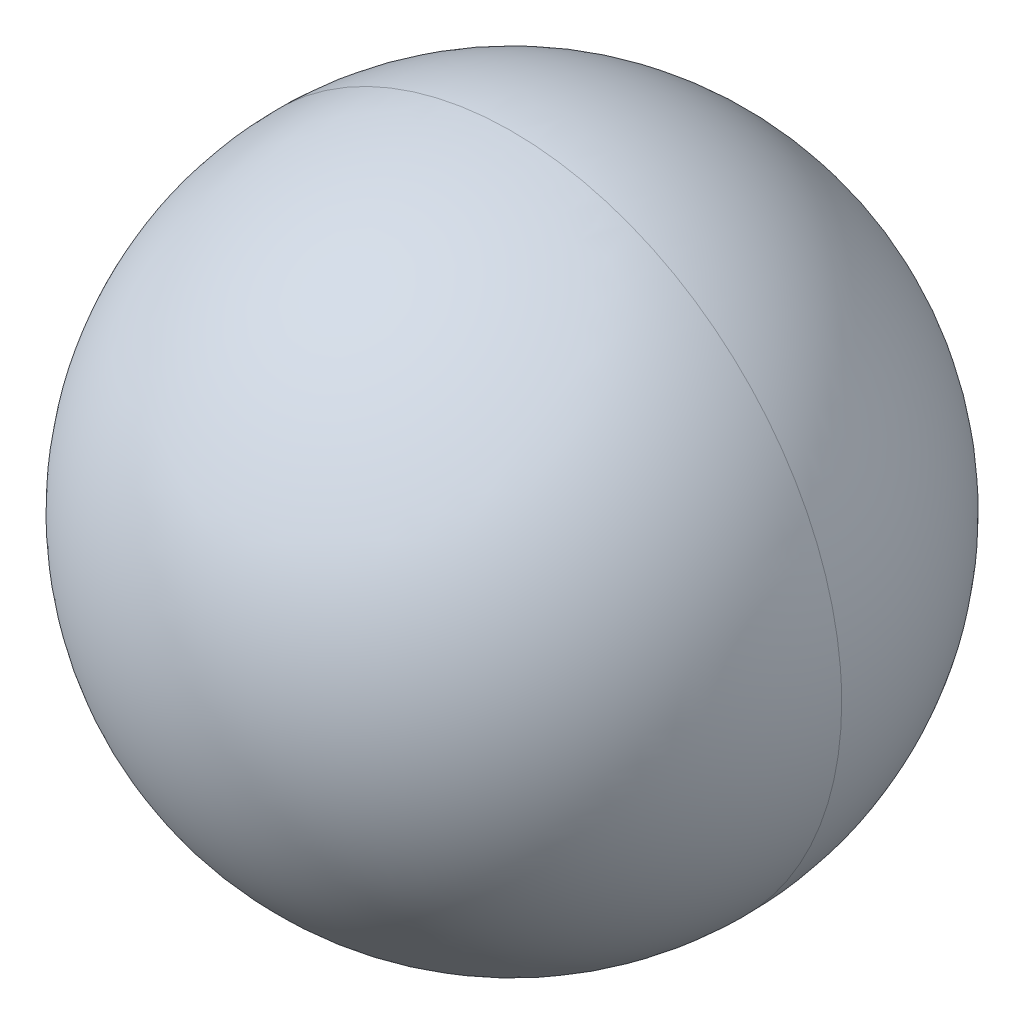
ISO-10303-21;
HEADER;
FILE_DESCRIPTION(('STEP AP214'),'2;1');
FILE_NAME('part.step','',(''),(''),'','','');
FILE_SCHEMA(('AUTOMOTIVE_DESIGN { 1 0 10303 214 1 1 1 1 }'));
ENDSEC;
DATA;
#1=APPLICATION_CONTEXT('core data for automotive mechanical design processes');
#2=APPLICATION_PROTOCOL_DEFINITION('international standard','automotive_design',2000,#1);
#3=PRODUCT_CONTEXT('',#1,'mechanical');
#4=PRODUCT('Part','Part','',(#3));
#5=PRODUCT_RELATED_PRODUCT_CATEGORY('part','',(#4));
#6=PRODUCT_DEFINITION_FORMATION('','',#4);
#7=PRODUCT_DEFINITION_CONTEXT('part definition',#1,'design');
#8=PRODUCT_DEFINITION('design','',#6,#7);
#9=PRODUCT_DEFINITION_SHAPE('','',#8);
#10=(LENGTH_UNIT() NAMED_UNIT(*) SI_UNIT(.MILLI.,.METRE.));
#11=(NAMED_UNIT(*) PLANE_ANGLE_UNIT() SI_UNIT($,.RADIAN.));
#12=(NAMED_UNIT(*) SI_UNIT($,.STERADIAN.) SOLID_ANGLE_UNIT());
#13=UNCERTAINTY_MEASURE_WITH_UNIT(LENGTH_MEASURE(1.E-05),#10,'distance_accuracy_value','');
#14=(GEOMETRIC_REPRESENTATION_CONTEXT(3) GLOBAL_UNCERTAINTY_ASSIGNED_CONTEXT((#13)) GLOBAL_UNIT_ASSIGNED_CONTEXT((#10,
#11,#12)) REPRESENTATION_CONTEXT('',''));
#15=CARTESIAN_POINT('',(0.,0.,0.));
#16=DIRECTION('',(0.,0.,1.));
#17=DIRECTION('',(1.,0.,0.));
#18=AXIS2_PLACEMENT_3D('',#15,#16,#17);
#19=CARTESIAN_POINT('',(8.,19.5,0.));
#20=DIRECTION('',(1.,0.,0.));
#21=DIRECTION('',(0.,0.,1.));
#22=AXIS2_PLACEMENT_3D('',#19,#20,#21);
#23=SPHERICAL_SURFACE('',#22,5.1595);
#24=CARTESIAN_POINT('',(8.,19.5,0.));
#25=DIRECTION('',(0.,0.,1.));
#26=DIRECTION('',(0.,-1.,0.));
#27=AXIS2_PLACEMENT_3D('',#24,#25,#26);
#28=CIRCLE('',#27,5.1595);
#29=CARTESIAN_POINT('',(2.8405,19.5,0.));
#30=VERTEX_POINT('',#29);
#31=CARTESIAN_POINT('',(13.1595,19.5,0.));
#32=VERTEX_POINT('',#31);
#33=EDGE_CURVE('E11',#30,#32,#28,.T.);
#34=ORIENTED_EDGE('',*,*,#33,.F.);
#35=CARTESIAN_POINT('',(2.8405,19.5,0.));
#36=CARTESIAN_POINT('',(2.84049820919547,19.5844222065871,0.));
#37=CARTESIAN_POINT('',(2.84257196684278,19.6688442607942,0.));
#38=CARTESIAN_POINT('',(2.85085772057605,19.8374850705904,0.));
#39=CARTESIAN_POINT('',(2.85706971666202,19.9217038261795,0.));
#40=CARTESIAN_POINT('',(2.87361908880758,20.0897350448813,0.));
#41=CARTESIAN_POINT('',(2.88395646486718,20.173547507994,0.));
#42=CARTESIAN_POINT('',(2.90873112880625,20.3405642579109,0.));
#43=CARTESIAN_POINT('',(2.92316841668573,20.4237685447151,0.));
#44=CARTESIAN_POINT('',(2.95610827483334,20.5893684881693,0.));
#45=CARTESIAN_POINT('',(2.97461084510147,20.6717641448193,0.));
#46=CARTESIAN_POINT('',(3.01563665318403,20.8355483316024,0.));
#47=CARTESIAN_POINT('',(3.03815989099846,20.9169368617355,0.));
#48=CARTESIAN_POINT('',(3.08717278458088,21.0785107228533,0.));
#49=CARTESIAN_POINT('',(3.11366244034887,21.158696053838,0.));
#50=CARTESIAN_POINT('',(3.17054435102754,21.3176703433163,0.));
#51=CARTESIAN_POINT('',(3.20093660593821,21.3964593018099,0.));
#52=CARTESIAN_POINT('',(3.26555049807782,21.5524510367655,0.));
#53=CARTESIAN_POINT('',(3.29977213530676,21.6296538132275,0.));
#54=CARTESIAN_POINT('',(3.37196234895243,21.7822871958796,0.));
#55=CARTESIAN_POINT('',(3.40993092536916,21.8577178020696,0.));
#56=CARTESIAN_POINT('',(3.48952354782016,22.0066251252378,0.));
#57=CARTESIAN_POINT('',(3.53114759385443,22.0801018422159,0.));
#58=CARTESIAN_POINT('',(3.61795087955276,22.2249243751139,0.));
#59=CARTESIAN_POINT('',(3.66313011921683,22.2962701910338,0.));
#60=CARTESIAN_POINT('',(3.7569349514332,22.4366590434955,0.));
#61=CARTESIAN_POINT('',(3.80556054398551,22.5057020800372,0.));
#62=CARTESIAN_POINT('',(3.90614093866571,22.6413190430202,0.));
#63=CARTESIAN_POINT('',(3.95809574079362,22.7078929694614,0.));
#64=CARTESIAN_POINT('',(4.06520939095629,22.8384113298233,0.));
#65=CARTESIAN_POINT('',(4.12036823899106,22.9023557637439,0.));
#66=CARTESIAN_POINT('',(4.23375709847111,23.0274610913225,0.));
#67=CARTESIAN_POINT('',(4.2919871099164,23.0886219849804,0.));
#68=CARTESIAN_POINT('',(4.4113780150196,23.2080128900836,0.));
#69=CARTESIAN_POINT('',(4.47253890867752,23.2662429015289,0.));
#70=CARTESIAN_POINT('',(4.59764423625609,23.3796317610089,0.));
#71=CARTESIAN_POINT('',(4.66158867017674,23.4347906090437,0.));
#72=CARTESIAN_POINT('',(4.79210703053859,23.5419042592064,0.));
#73=CARTESIAN_POINT('',(4.8586809569798,23.5938590613343,0.));
#74=CARTESIAN_POINT('',(4.99429791996277,23.6944394560144,0.));
#75=CARTESIAN_POINT('',(5.06334095650454,23.7430650485665,0.));
#76=CARTESIAN_POINT('',(5.20372980896617,23.8368698807834,0.));
#77=CARTESIAN_POINT('',(5.27507562488602,23.8820491204481,0.));
#78=CARTESIAN_POINT('',(5.41989815778411,23.9688524061447,0.));
#79=CARTESIAN_POINT('',(5.49337487476234,24.0104764521764,0.));
#80=CARTESIAN_POINT('',(5.64228219793018,24.0900690746343,0.));
#81=CARTESIAN_POINT('',(5.71771280411978,24.1280376510603,0.));
#82=CARTESIAN_POINT('',(5.87034618677312,24.2002278646805,0.));
#83=CARTESIAN_POINT('',(5.94754896323685,24.2344495018746,0.));
#84=CARTESIAN_POINT('',(6.10354069818777,24.2990633941094,0.));
#85=CARTESIAN_POINT('',(6.18232965667496,24.32945564915,0.));
#86=CARTESIAN_POINT('',(6.3413039461707,24.3863375594735,0.));
#87=CARTESIAN_POINT('',(6.42148927717926,24.4128272147563,0.));
#88=CARTESIAN_POINT('',(6.58306313823193,24.4618401096643,0.));
#89=CARTESIAN_POINT('',(6.66445166827604,24.4843633492895,0.));
#90=CARTESIAN_POINT('',(6.82823585530216,24.525389152425,0.));
#91=CARTESIAN_POINT('',(6.91063151228416,24.5438917159355,0.));
#92=CARTESIAN_POINT('',(7.07623145483139,24.5768315925455,0.));
#93=CARTESIAN_POINT('',(7.15943574039661,24.591268905645,0.));
#94=CARTESIAN_POINT('',(7.3264524936985,24.6160435006815,0.));
#95=CARTESIAN_POINT('',(7.41026496143517,24.6263807826184,0.));
#96=CARTESIAN_POINT('',(7.57829616750408,24.642930411912,0.));
#97=CARTESIAN_POINT('',(7.66251490583632,24.6491427592686,0.));
#98=CARTESIAN_POINT('',(7.83115576277904,24.6574275533126,0.));
#99=CARTESIAN_POINT('',(7.91557788138951,24.6595,0.));
#100=CARTESIAN_POINT('',(8.08442211861047,24.6595,0.));
#101=CARTESIAN_POINT('',(8.16884423722094,24.6574275533126,0.));
#102=CARTESIAN_POINT('',(8.33748509416366,24.6491427592686,0.));
#103=CARTESIAN_POINT('',(8.4217038324959,24.642930411912,0.));
#104=CARTESIAN_POINT('',(8.58973503856481,24.6263807826184,0.));
#105=CARTESIAN_POINT('',(8.67354750630148,24.6160435006815,0.));
#106=CARTESIAN_POINT('',(8.84056425960337,24.591268905645,0.));
#107=CARTESIAN_POINT('',(8.92376854516859,24.5768315925455,0.));
#108=CARTESIAN_POINT('',(9.08936848771581,24.5438917159355,0.));
#109=CARTESIAN_POINT('',(9.17176414469782,24.525389152425,0.));
#110=CARTESIAN_POINT('',(9.33554833172394,24.4843633492895,0.));
#111=CARTESIAN_POINT('',(9.41693686176805,24.4618401096643,0.));
#112=CARTESIAN_POINT('',(9.57851072282072,24.4128272147564,0.));
#113=CARTESIAN_POINT('',(9.65869605382928,24.3863375594735,0.));
#114=CARTESIAN_POINT('',(9.81767034332502,24.3294556491501,0.));
#115=CARTESIAN_POINT('',(9.89645930181221,24.2990633941094,0.));
#116=CARTESIAN_POINT('',(10.0524510367631,24.2344495018746,0.));
#117=CARTESIAN_POINT('',(10.1296538132269,24.2002278646805,0.));
#118=CARTESIAN_POINT('',(10.2822871958802,24.1280376510603,0.));
#119=CARTESIAN_POINT('',(10.3577178020698,24.0900690746343,0.));
#120=CARTESIAN_POINT('',(10.5066251252376,24.0104764521764,0.));
#121=CARTESIAN_POINT('',(10.5801018422159,23.9688524061447,0.));
#122=CARTESIAN_POINT('',(10.724924375114,23.8820491204482,0.));
#123=CARTESIAN_POINT('',(10.7962701910338,23.8368698807834,0.));
#124=CARTESIAN_POINT('',(10.9366590434954,23.7430650485666,0.));
#125=CARTESIAN_POINT('',(11.0057020800372,23.6944394560144,0.));
#126=CARTESIAN_POINT('',(11.1413190430202,23.5938590613344,0.));
#127=CARTESIAN_POINT('',(11.2078929694614,23.5419042592064,0.));
#128=CARTESIAN_POINT('',(11.3384113298232,23.4347906090437,0.));
#129=CARTESIAN_POINT('',(11.4023557637439,23.3796317610089,0.));
#130=CARTESIAN_POINT('',(11.5274610913225,23.2662429015289,0.));
#131=CARTESIAN_POINT('',(11.5886219849804,23.2080128900836,0.));
#132=CARTESIAN_POINT('',(11.7080128900836,23.0886219849804,0.));
#133=CARTESIAN_POINT('',(11.7662429015289,23.0274610913225,0.));
#134=CARTESIAN_POINT('',(11.8796317610089,22.9023557637439,0.));
#135=CARTESIAN_POINT('',(11.9347906090437,22.8384113298233,0.));
#136=CARTESIAN_POINT('',(12.0419042592064,22.7078929694614,0.));
#137=CARTESIAN_POINT('',(12.0938590613343,22.6413190430202,0.));
#138=CARTESIAN_POINT('',(12.1944394560145,22.5057020800372,0.));
#139=CARTESIAN_POINT('',(12.2430650485668,22.4366590434955,0.));
#140=CARTESIAN_POINT('',(12.3368698807832,22.2962701910338,0.));
#141=CARTESIAN_POINT('',(12.3820491204472,22.2249243751139,0.));
#142=CARTESIAN_POINT('',(12.4688524061456,22.0801018422159,0.));
#143=CARTESIAN_POINT('',(12.5104764521798,22.0066251252378,0.));
#144=CARTESIAN_POINT('',(12.5900690746308,21.8577178020697,0.));
#145=CARTESIAN_POINT('',(12.6280376510476,21.7822871958796,0.));
#146=CARTESIAN_POINT('',(12.7002278646932,21.6296538132275,0.));
#147=CARTESIAN_POINT('',(12.7344495019222,21.5524510367655,0.));
#148=CARTESIAN_POINT('',(12.7990633940618,21.3964593018099,0.));
#149=CARTESIAN_POINT('',(12.8294556489725,21.3176703433163,0.));
#150=CARTESIAN_POINT('',(12.8863375596511,21.158696053838,0.));
#151=CARTESIAN_POINT('',(12.9128272154191,21.0785107228533,0.));
#152=CARTESIAN_POINT('',(12.9618401090015,20.9169368617355,0.));
#153=CARTESIAN_POINT('',(12.984363346816,20.8355483316024,0.));
#154=CARTESIAN_POINT('',(13.0253891548985,20.6717641448194,0.));
#155=CARTESIAN_POINT('',(13.0438917251667,20.5893684881693,0.));
#156=CARTESIAN_POINT('',(13.0768315833143,20.4237685447151,0.));
#157=CARTESIAN_POINT('',(13.0912688711938,20.3405642579109,0.));
#158=CARTESIAN_POINT('',(13.1160435351328,20.173547507994,0.));
#159=CARTESIAN_POINT('',(13.1263809111924,20.0897350448813,0.));
#160=CARTESIAN_POINT('',(13.142930283338,19.9217038261795,0.));
#161=CARTESIAN_POINT('',(13.1491422794239,19.8374850705904,0.));
#162=CARTESIAN_POINT('',(13.1574280331572,19.6688442607942,0.));
#163=CARTESIAN_POINT('',(13.1595017908045,19.5844222065871,0.));
#164=CARTESIAN_POINT('',(13.1595,19.5,0.));
#165=B_SPLINE_CURVE_WITH_KNOTS('',3,(#35,#36,#37,#38,#39,#40,#41,#42,#43,#44,#45,#46,#47,#48,
#49,#50,#51,#52,#53,#54,#55,#56,#57,#58,#59,#60,#61,#62,#63,#64,#65,#66,#67,#68,#69,#70,#71,#72,
#73,#74,#75,#76,#77,#78,#79,#80,#81,#82,#83,#84,#85,#86,#87,#88,#89,#90,#91,#92,#93,#94,#95,#96,
#97,#98,#99,#100,#101,#102,#103,#104,#105,#106,#107,#108,#109,#110,#111,#112,#113,#114,#115,
#116,#117,#118,#119,#120,#121,#122,#123,#124,#125,#126,#127,#128,#129,#130,#131,#132,#133,#134,
#135,#136,#137,#138,#139,#140,#141,#142,#143,#144,#145,#146,#147,#148,#149,#150,#151,#152,#153,
#154,#155,#156,#157,#158,#159,#160,#161,#162,#163,#164),.UNSPECIFIED.,.F.,.F.,(4,2,2,2,2,2,2,2,
2,2,2,2,2,2,2,2,2,2,2,2,2,2,2,2,2,2,2,2,2,2,2,2,2,2,2,2,2,2,2,2,2,2,2,2,2,2,2,2,2,2,2,2,2,2,2,2,
2,2,2,2,2,2,2,2,4),(0.,0.253240937127929,0.506481874255863,0.759722811383793,1.01296374851173,
1.26620468563966,1.51944562276759,1.77268655989552,2.02592749702345,2.27916843415139,
2.53240937127932,2.78565030840725,3.03889124553518,3.29213218266311,3.54537311979104,
3.79861405691897,4.05185499404691,4.30509593117484,4.55833686830277,4.8115778054307,
5.06481874255863,5.31805967968656,5.5713006168145,5.82454155394243,6.07778249107036,
6.33102342819829,6.58426436532622,6.83750530245415,7.09074623958209,7.34398717671002,
7.59722811383795,7.85046905096588,8.10370998809381,8.35695092522175,8.61019186234968,
8.86343279947761,9.11667373660554,9.36991467373347,9.62315561086141,9.87639654798934,
10.1296374851173,10.3828784222452,10.6361193593731,10.8893602965011,11.142601233629,
11.3958421707569,11.6490831078849,11.9023240450128,12.1555649821407,12.4088059192687,
12.6620468563966,12.9152877935245,13.1685287306525,13.4217696677804,13.6750106049083,
13.9282515420362,14.1814924791642,14.4347334162921,14.68797435342,14.941215290548,
15.1944562276759,15.4476971648038,15.7009381019318,15.9541790390597,16.2074199761876),.UNSPECIFIED.);
#166=EDGE_CURVE('E25',#30,#32,#165,.T.);
#167=ORIENTED_EDGE('',*,*,#166,.T.);
#168=EDGE_LOOP('',(#34,#167));
#169=FACE_BOUND('',#168,.T.);
#170=ADVANCED_FACE('F16',(#169),#23,.T.);
#171=CARTESIAN_POINT('',(8.,19.5,0.));
#172=DIRECTION('',(1.,0.,0.));
#173=DIRECTION('',(0.,0.,-1.));
#174=AXIS2_PLACEMENT_3D('',#171,#172,#173);
#175=SPHERICAL_SURFACE('',#174,5.1595);
#176=ORIENTED_EDGE('',*,*,#33,.T.);
#177=ORIENTED_EDGE('',*,*,#166,.F.);
#178=EDGE_LOOP('',(#176,#177));
#179=FACE_BOUND('',#178,.T.);
#180=ADVANCED_FACE('F35',(#179),#175,.T.);
#181=CLOSED_SHELL('',(#170,#180));
#182=MANIFOLD_SOLID_BREP('B1',#181);
#183=ADVANCED_BREP_SHAPE_REPRESENTATION('',(#18,#182),#14);
#184=SHAPE_DEFINITION_REPRESENTATION(#9,#183);
ENDSEC;
END-ISO-10303-21;
